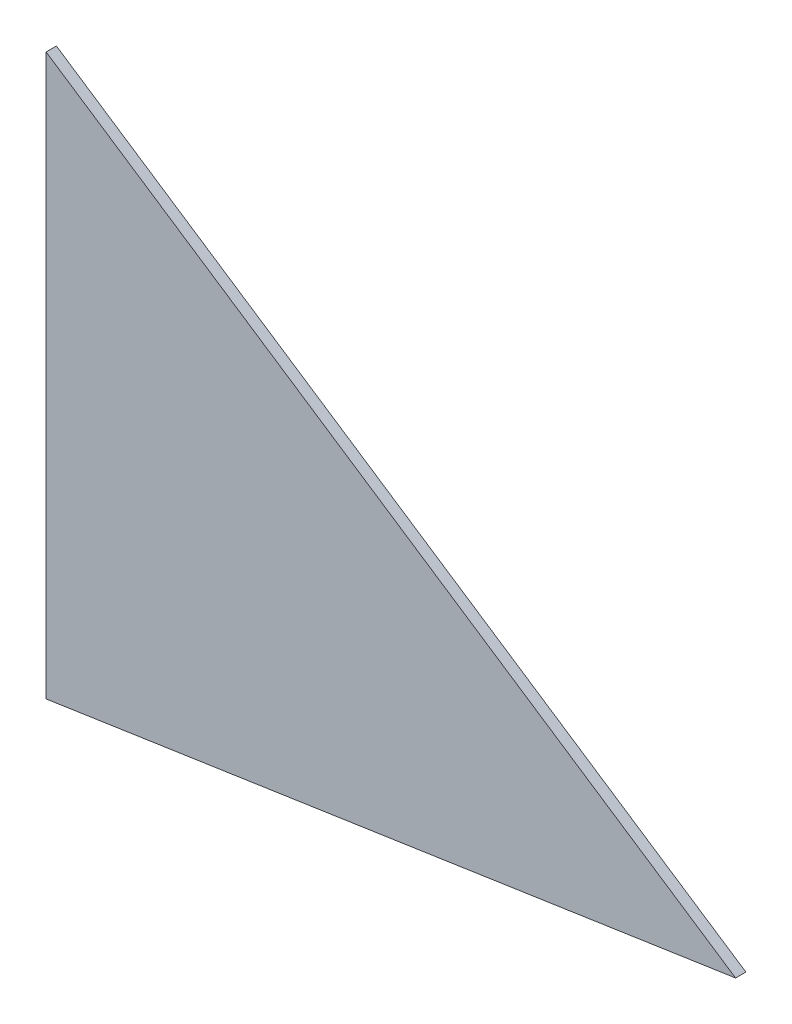
ISO-10303-21;
HEADER;
FILE_DESCRIPTION(('STEP AP214'),'2;1');
FILE_NAME('part.step','',(''),(''),'','','');
FILE_SCHEMA(('AUTOMOTIVE_DESIGN { 1 0 10303 214 1 1 1 1 }'));
ENDSEC;
DATA;
#1=APPLICATION_CONTEXT('core data for automotive mechanical design processes');
#2=APPLICATION_PROTOCOL_DEFINITION('international standard','automotive_design',2000,#1);
#3=PRODUCT_CONTEXT('',#1,'mechanical');
#4=PRODUCT('Part','Part','',(#3));
#5=PRODUCT_RELATED_PRODUCT_CATEGORY('part','',(#4));
#6=PRODUCT_DEFINITION_FORMATION('','',#4);
#7=PRODUCT_DEFINITION_CONTEXT('part definition',#1,'design');
#8=PRODUCT_DEFINITION('design','',#6,#7);
#9=PRODUCT_DEFINITION_SHAPE('','',#8);
#10=(LENGTH_UNIT() NAMED_UNIT(*) SI_UNIT(.MILLI.,.METRE.));
#11=(NAMED_UNIT(*) PLANE_ANGLE_UNIT() SI_UNIT($,.RADIAN.));
#12=(NAMED_UNIT(*) SI_UNIT($,.STERADIAN.) SOLID_ANGLE_UNIT());
#13=UNCERTAINTY_MEASURE_WITH_UNIT(LENGTH_MEASURE(1.E-05),#10,'distance_accuracy_value','');
#14=(GEOMETRIC_REPRESENTATION_CONTEXT(3) GLOBAL_UNCERTAINTY_ASSIGNED_CONTEXT((#13)) GLOBAL_UNIT_ASSIGNED_CONTEXT((#10,
#11,#12)) REPRESENTATION_CONTEXT('',''));
#15=CARTESIAN_POINT('',(0.,0.,0.));
#16=DIRECTION('',(0.,0.,1.));
#17=DIRECTION('',(1.,0.,0.));
#18=AXIS2_PLACEMENT_3D('',#15,#16,#17);
#19=CARTESIAN_POINT('',(-233.875284897176,-176.840766639277,10.));
#20=DIRECTION('',(-0.552689714472757,-0.833387112640952,0.));
#21=DIRECTION('',(0.833387112640952,-0.552689714472757,0.));
#22=AXIS2_PLACEMENT_3D('',#19,#20,#21);
#23=PLANE('',#22);
#24=DIRECTION('',(-0.833387112640952,0.552689714472757,0.));
#25=VECTOR('',#24,1.);
#26=CARTESIAN_POINT('',(-233.875284897176,-176.840766639277,0.));
#27=LINE('',#26,#25);
#28=CARTESIAN_POINT('',(-233.875284897176,-176.840766639277,0.));
#29=VERTEX_POINT('',#28);
#30=CARTESIAN_POINT('',(-903.923901621273,267.525330511609,0.));
#31=VERTEX_POINT('',#30);
#32=EDGE_CURVE('E81',#29,#31,#27,.T.);
#33=ORIENTED_EDGE('',*,*,#32,.T.);
#34=DIRECTION('',(0.,0.,-1.));
#35=VECTOR('',#34,1.);
#36=CARTESIAN_POINT('',(-903.923901621273,267.525330511609,10.));
#37=LINE('',#36,#35);
#38=CARTESIAN_POINT('',(-903.923901621273,267.525330511609,10.));
#39=VERTEX_POINT('',#38);
#40=EDGE_CURVE('E11',#39,#31,#37,.T.);
#41=ORIENTED_EDGE('',*,*,#40,.F.);
#42=DIRECTION('',(-0.833387112640952,0.552689714472757,0.));
#43=VECTOR('',#42,1.);
#44=CARTESIAN_POINT('',(-233.875284897176,-176.840766639277,10.));
#45=LINE('',#44,#43);
#46=CARTESIAN_POINT('',(-233.875284897176,-176.840766639277,10.));
#47=VERTEX_POINT('',#46);
#48=EDGE_CURVE('E76',#47,#39,#45,.T.);
#49=ORIENTED_EDGE('',*,*,#48,.F.);
#50=DIRECTION('',(0.,0.,-1.));
#51=VECTOR('',#50,1.);
#52=CARTESIAN_POINT('',(-233.875284897176,-176.840766639277,10.));
#53=LINE('',#52,#51);
#54=EDGE_CURVE('E51',#47,#29,#53,.T.);
#55=ORIENTED_EDGE('',*,*,#54,.T.);
#56=EDGE_LOOP('',(#33,#41,#49,#55));
#57=FACE_BOUND('',#56,.T.);
#58=ADVANCED_FACE('F35',(#57),#23,.F.);
#59=CARTESIAN_POINT('',(-903.923901621273,267.525330511609,10.));
#60=DIRECTION('',(1.,0.,0.));
#61=DIRECTION('',(0.,0.,-1.));
#62=AXIS2_PLACEMENT_3D('',#59,#60,#61);
#63=PLANE('',#62);
#64=DIRECTION('',(0.,-1.,0.));
#65=VECTOR('',#64,1.);
#66=CARTESIAN_POINT('',(-903.923901621273,267.525330511609,0.));
#67=LINE('',#66,#65);
#68=CARTESIAN_POINT('',(-903.923901621273,-277.009091384816,0.));
#69=VERTEX_POINT('',#68);
#70=EDGE_CURVE('E84',#31,#69,#67,.T.);
#71=ORIENTED_EDGE('',*,*,#70,.T.);
#72=DIRECTION('',(0.,0.,-1.));
#73=VECTOR('',#72,1.);
#74=CARTESIAN_POINT('',(-903.923901621273,-277.009091384816,10.));
#75=LINE('',#74,#73);
#76=CARTESIAN_POINT('',(-903.923901621273,-277.009091384816,10.));
#77=VERTEX_POINT('',#76);
#78=EDGE_CURVE('E43',#77,#69,#75,.T.);
#79=ORIENTED_EDGE('',*,*,#78,.F.);
#80=DIRECTION('',(0.,-1.,0.));
#81=VECTOR('',#80,1.);
#82=CARTESIAN_POINT('',(-903.923901621273,267.525330511609,10.));
#83=LINE('',#82,#81);
#84=EDGE_CURVE('E69',#39,#77,#83,.T.);
#85=ORIENTED_EDGE('',*,*,#84,.F.);
#86=ORIENTED_EDGE('',*,*,#40,.T.);
#87=EDGE_LOOP('',(#71,#79,#85,#86));
#88=FACE_BOUND('',#87,.T.);
#89=ADVANCED_FACE('F71',(#88),#63,.F.);
#90=CARTESIAN_POINT('',(-233.875284897176,-176.840766639277,10.));
#91=DIRECTION('',(0.147851118919844,-0.989009629191825,0.));
#92=DIRECTION('',(0.989009629191825,0.147851118919844,0.));
#93=AXIS2_PLACEMENT_3D('',#90,#91,#92);
#94=PLANE('',#93);
#95=DIRECTION('',(-0.989009629191825,-0.147851118919844,0.));
#96=VECTOR('',#95,1.);
#97=CARTESIAN_POINT('',(-233.875284897176,-176.840766639277,0.));
#98=LINE('',#97,#96);
#99=EDGE_CURVE('E79',#29,#69,#98,.T.);
#100=ORIENTED_EDGE('',*,*,#99,.F.);
#101=ORIENTED_EDGE('',*,*,#54,.F.);
#102=DIRECTION('',(-0.989009629191825,-0.147851118919844,0.));
#103=VECTOR('',#102,1.);
#104=CARTESIAN_POINT('',(-233.875284897176,-176.840766639277,10.));
#105=LINE('',#104,#103);
#106=EDGE_CURVE('E75',#47,#77,#105,.T.);
#107=ORIENTED_EDGE('',*,*,#106,.T.);
#108=ORIENTED_EDGE('',*,*,#78,.T.);
#109=EDGE_LOOP('',(#100,#101,#107,#108));
#110=FACE_BOUND('',#109,.T.);
#111=ADVANCED_FACE('F90',(#110),#94,.T.);
#112=CARTESIAN_POINT('',(0.,0.,10.));
#113=DIRECTION('',(0.,0.,1.));
#114=DIRECTION('',(1.,0.,0.));
#115=AXIS2_PLACEMENT_3D('',#112,#113,#114);
#116=PLANE('',#115);
#117=ORIENTED_EDGE('',*,*,#48,.T.);
#118=ORIENTED_EDGE('',*,*,#84,.T.);
#119=ORIENTED_EDGE('',*,*,#106,.F.);
#120=EDGE_LOOP('',(#117,#118,#119));
#121=FACE_BOUND('',#120,.T.);
#122=ADVANCED_FACE('F78',(#121),#116,.T.);
#123=CARTESIAN_POINT('',(0.,0.,0.));
#124=DIRECTION('',(0.,0.,1.));
#125=DIRECTION('',(1.,0.,0.));
#126=AXIS2_PLACEMENT_3D('',#123,#124,#125);
#127=PLANE('',#126);
#128=ORIENTED_EDGE('',*,*,#32,.F.);
#129=ORIENTED_EDGE('',*,*,#99,.T.);
#130=ORIENTED_EDGE('',*,*,#70,.F.);
#131=EDGE_LOOP('',(#128,#129,#130));
#132=FACE_BOUND('',#131,.T.);
#133=ADVANCED_FACE('F97',(#132),#127,.F.);
#134=CLOSED_SHELL('',(#58,#89,#111,#122,#133));
#135=MANIFOLD_SOLID_BREP('B2',#134);
#136=ADVANCED_BREP_SHAPE_REPRESENTATION('',(#18,#135),#14);
#137=SHAPE_DEFINITION_REPRESENTATION(#9,#136);
ENDSEC;
END-ISO-10303-21;
